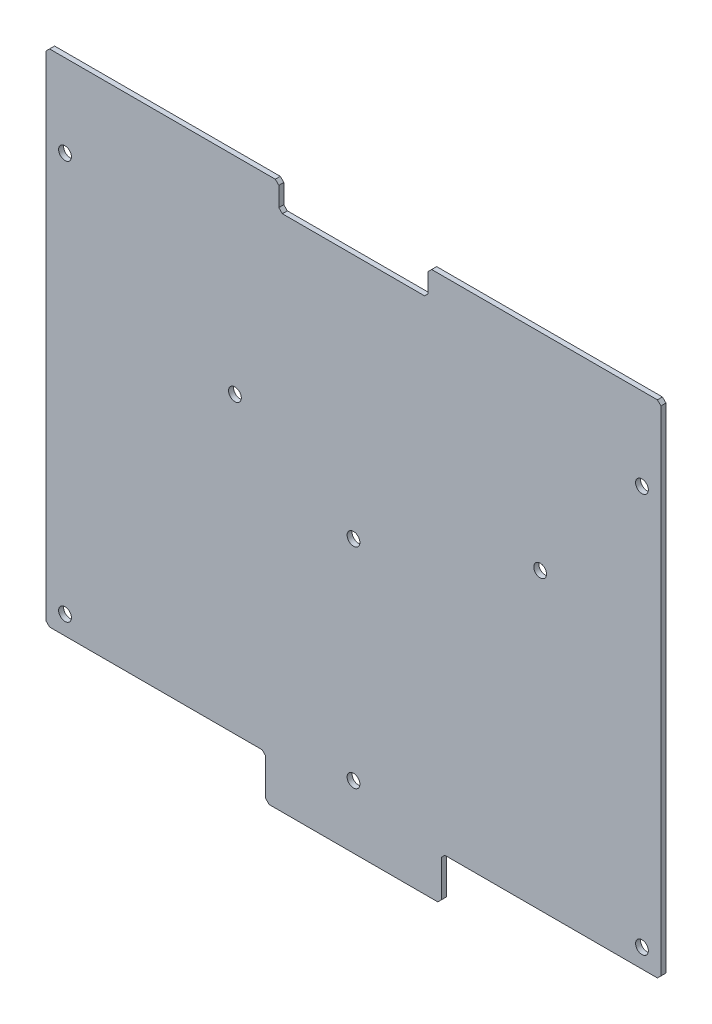
ISO-10303-21;
HEADER;
FILE_DESCRIPTION(('STEP AP214'),'2;1');
FILE_NAME('part.step','',(''),(''),'','','');
FILE_SCHEMA(('AUTOMOTIVE_DESIGN { 1 0 10303 214 1 1 1 1 }'));
ENDSEC;
DATA;
#1=APPLICATION_CONTEXT('core data for automotive mechanical design processes');
#2=APPLICATION_PROTOCOL_DEFINITION('international standard','automotive_design',2000,#1);
#3=PRODUCT_CONTEXT('',#1,'mechanical');
#4=PRODUCT('Part','Part','',(#3));
#5=PRODUCT_RELATED_PRODUCT_CATEGORY('part','',(#4));
#6=PRODUCT_DEFINITION_FORMATION('','',#4);
#7=PRODUCT_DEFINITION_CONTEXT('part definition',#1,'design');
#8=PRODUCT_DEFINITION('design','',#6,#7);
#9=PRODUCT_DEFINITION_SHAPE('','',#8);
#10=(LENGTH_UNIT() NAMED_UNIT(*) SI_UNIT(.MILLI.,.METRE.));
#11=(NAMED_UNIT(*) PLANE_ANGLE_UNIT() SI_UNIT($,.RADIAN.));
#12=(NAMED_UNIT(*) SI_UNIT($,.STERADIAN.) SOLID_ANGLE_UNIT());
#13=UNCERTAINTY_MEASURE_WITH_UNIT(LENGTH_MEASURE(1.E-05),#10,'distance_accuracy_value','');
#14=(GEOMETRIC_REPRESENTATION_CONTEXT(3) GLOBAL_UNCERTAINTY_ASSIGNED_CONTEXT((#13)) GLOBAL_UNIT_ASSIGNED_CONTEXT((#10,
#11,#12)) REPRESENTATION_CONTEXT('',''));
#15=CARTESIAN_POINT('',(0.,0.,0.));
#16=DIRECTION('',(0.,0.,1.));
#17=DIRECTION('',(1.,0.,0.));
#18=AXIS2_PLACEMENT_3D('',#15,#16,#17);
#19=CARTESIAN_POINT('',(0.,0.,1.4478));
#20=DIRECTION('',(0.,0.,1.));
#21=DIRECTION('',(1.,0.,0.));
#22=AXIS2_PLACEMENT_3D('',#19,#20,#21);
#23=PLANE('',#22);
#24=CARTESIAN_POINT('',(5.4864,120.904,1.4478));
#25=DIRECTION('',(0.,0.,1.));
#26=DIRECTION('',(1.,0.,0.));
#27=AXIS2_PLACEMENT_3D('',#24,#25,#26);
#28=CIRCLE('',#27,1.84912);
#29=CARTESIAN_POINT('',(7.33552,120.904,1.4478));
#30=VERTEX_POINT('',#29);
#31=EDGE_CURVE('E226',#30,#30,#28,.F.);
#32=ORIENTED_EDGE('',*,*,#31,.T.);
#33=EDGE_LOOP('',(#32));
#34=FACE_BOUND('',#33,.T.);
#35=CARTESIAN_POINT('',(142.875,85.09,1.4478));
#36=DIRECTION('',(0.,0.,1.));
#37=DIRECTION('',(1.,0.,0.));
#38=AXIS2_PLACEMENT_3D('',#35,#36,#37);
#39=CIRCLE('',#38,1.84912);
#40=CARTESIAN_POINT('',(144.72412,85.09,1.4478));
#41=VERTEX_POINT('',#40);
#42=EDGE_CURVE('E229',#41,#41,#39,.F.);
#43=ORIENTED_EDGE('',*,*,#42,.T.);
#44=EDGE_LOOP('',(#43));
#45=FACE_BOUND('',#44,.T.);
#46=CARTESIAN_POINT('',(54.61,85.09,1.4478));
#47=DIRECTION('',(0.,0.,1.));
#48=DIRECTION('',(1.,0.,0.));
#49=AXIS2_PLACEMENT_3D('',#46,#47,#48);
#50=CIRCLE('',#49,1.84912);
#51=CARTESIAN_POINT('',(56.45912,85.09,1.4478));
#52=VERTEX_POINT('',#51);
#53=EDGE_CURVE('E232',#52,#52,#50,.F.);
#54=ORIENTED_EDGE('',*,*,#53,.T.);
#55=EDGE_LOOP('',(#54));
#56=FACE_BOUND('',#55,.T.);
#57=CARTESIAN_POINT('',(88.9,66.04,1.4478));
#58=DIRECTION('',(0.,0.,1.));
#59=DIRECTION('',(1.,0.,0.));
#60=AXIS2_PLACEMENT_3D('',#57,#58,#59);
#61=CIRCLE('',#60,1.84912);
#62=CARTESIAN_POINT('',(90.74912,66.04,1.4478));
#63=VERTEX_POINT('',#62);
#64=EDGE_CURVE('E235',#63,#63,#61,.F.);
#65=ORIENTED_EDGE('',*,*,#64,.T.);
#66=EDGE_LOOP('',(#65));
#67=FACE_BOUND('',#66,.T.);
#68=CARTESIAN_POINT('',(88.9,5.4864,1.4478));
#69=DIRECTION('',(0.,0.,1.));
#70=DIRECTION('',(1.,0.,0.));
#71=AXIS2_PLACEMENT_3D('',#68,#69,#70);
#72=CIRCLE('',#71,1.84912);
#73=CARTESIAN_POINT('',(90.74912,5.4864,1.4478));
#74=VERTEX_POINT('',#73);
#75=EDGE_CURVE('E238',#74,#74,#72,.F.);
#76=ORIENTED_EDGE('',*,*,#75,.T.);
#77=EDGE_LOOP('',(#76));
#78=FACE_BOUND('',#77,.T.);
#79=CARTESIAN_POINT('',(172.3136,5.4864,1.4478));
#80=DIRECTION('',(0.,0.,1.));
#81=DIRECTION('',(1.,0.,0.));
#82=AXIS2_PLACEMENT_3D('',#79,#80,#81);
#83=CIRCLE('',#82,1.84912);
#84=CARTESIAN_POINT('',(174.16272,5.4864,1.4478));
#85=VERTEX_POINT('',#84);
#86=EDGE_CURVE('E241',#85,#85,#83,.F.);
#87=ORIENTED_EDGE('',*,*,#86,.T.);
#88=EDGE_LOOP('',(#87));
#89=FACE_BOUND('',#88,.T.);
#90=CARTESIAN_POINT('',(5.4864,5.4864,1.4478));
#91=DIRECTION('',(0.,0.,1.));
#92=DIRECTION('',(1.,0.,0.));
#93=AXIS2_PLACEMENT_3D('',#90,#91,#92);
#94=CIRCLE('',#93,1.84912);
#95=CARTESIAN_POINT('',(7.33552,5.4864,1.4478));
#96=VERTEX_POINT('',#95);
#97=EDGE_CURVE('E243',#96,#96,#94,.F.);
#98=ORIENTED_EDGE('',*,*,#97,.T.);
#99=EDGE_LOOP('',(#98));
#100=FACE_BOUND('',#99,.T.);
#101=CARTESIAN_POINT('',(172.3136,120.904,1.4478));
#102=DIRECTION('',(0.,0.,1.));
#103=DIRECTION('',(1.,0.,0.));
#104=AXIS2_PLACEMENT_3D('',#101,#102,#103);
#105=CIRCLE('',#104,1.84912);
#106=CARTESIAN_POINT('',(174.16272,120.904,1.4478));
#107=VERTEX_POINT('',#106);
#108=EDGE_CURVE('E20',#107,#107,#105,.F.);
#109=ORIENTED_EDGE('',*,*,#108,.T.);
#110=EDGE_LOOP('',(#109));
#111=FACE_BOUND('',#110,.T.);
#112=DIRECTION('',(1.,0.,0.));
#113=VECTOR('',#112,1.);
#114=CARTESIAN_POINT('',(63.5,-12.7,1.4478));
#115=LINE('',#114,#113);
#116=CARTESIAN_POINT('',(113.284,-12.7,1.4478));
#117=VERTEX_POINT('',#116);
#118=CARTESIAN_POINT('',(64.516,-12.7,1.4478));
#119=VERTEX_POINT('',#118);
#120=EDGE_CURVE('E193',#117,#119,#115,.F.);
#121=ORIENTED_EDGE('',*,*,#120,.F.);
#122=DIRECTION('',(0.707106781186498,0.707106781186598,0.));
#123=VECTOR('',#122,1.);
#124=CARTESIAN_POINT('',(113.792,-12.192,1.4478));
#125=LINE('',#124,#123);
#126=CARTESIAN_POINT('',(114.3,-11.684,1.4478));
#127=VERTEX_POINT('',#126);
#128=EDGE_CURVE('E189',#127,#117,#125,.F.);
#129=ORIENTED_EDGE('',*,*,#128,.F.);
#130=DIRECTION('',(0.,1.,0.));
#131=VECTOR('',#130,1.);
#132=CARTESIAN_POINT('',(114.3,-12.7,1.4478));
#133=LINE('',#132,#131);
#134=CARTESIAN_POINT('',(114.3,-1.01599999999999,1.4478));
#135=VERTEX_POINT('',#134);
#136=EDGE_CURVE('E180',#135,#127,#133,.F.);
#137=ORIENTED_EDGE('',*,*,#136,.F.);
#138=DIRECTION('',(0.707106781186598,0.707106781186498,0.));
#139=VECTOR('',#138,1.);
#140=CARTESIAN_POINT('',(114.808,-0.508,1.4478));
#141=LINE('',#140,#139);
#142=CARTESIAN_POINT('',(115.316,0.,1.4478));
#143=VERTEX_POINT('',#142);
#144=EDGE_CURVE('E175',#143,#135,#141,.F.);
#145=ORIENTED_EDGE('',*,*,#144,.F.);
#146=DIRECTION('',(1.,0.,0.));
#147=VECTOR('',#146,1.);
#148=CARTESIAN_POINT('',(0.,0.,1.4478));
#149=LINE('',#148,#147);
#150=CARTESIAN_POINT('',(176.784,0.,1.4478));
#151=VERTEX_POINT('',#150);
#152=EDGE_CURVE('E342',#151,#143,#149,.F.);
#153=ORIENTED_EDGE('',*,*,#152,.F.);
#154=DIRECTION('',(0.707106781186548,0.707106781186548,0.));
#155=VECTOR('',#154,1.);
#156=CARTESIAN_POINT('',(177.292,0.508,1.4478));
#157=LINE('',#156,#155);
#158=CARTESIAN_POINT('',(177.8,1.016,1.4478));
#159=VERTEX_POINT('',#158);
#160=EDGE_CURVE('E338',#159,#151,#157,.F.);
#161=ORIENTED_EDGE('',*,*,#160,.F.);
#162=DIRECTION('',(0.,1.,0.));
#163=VECTOR('',#162,1.);
#164=CARTESIAN_POINT('',(177.8,0.,1.4478));
#165=LINE('',#164,#163);
#166=CARTESIAN_POINT('',(177.8,143.764,1.4478));
#167=VERTEX_POINT('',#166);
#168=EDGE_CURVE('E334',#167,#159,#165,.F.);
#169=ORIENTED_EDGE('',*,*,#168,.F.);
#170=DIRECTION('',(-0.707106781186548,0.707106781186548,0.));
#171=VECTOR('',#170,1.);
#172=CARTESIAN_POINT('',(177.292,144.272,1.4478));
#173=LINE('',#172,#171);
#174=CARTESIAN_POINT('',(176.784,144.78,1.4478));
#175=VERTEX_POINT('',#174);
#176=EDGE_CURVE('E330',#175,#167,#173,.F.);
#177=ORIENTED_EDGE('',*,*,#176,.F.);
#178=DIRECTION('',(1.,0.,0.));
#179=VECTOR('',#178,1.);
#180=CARTESIAN_POINT('',(177.8,144.78,1.4478));
#181=LINE('',#180,#179);
#182=CARTESIAN_POINT('',(111.506,144.78,1.4478));
#183=VERTEX_POINT('',#182);
#184=EDGE_CURVE('E326',#183,#175,#181,.T.);
#185=ORIENTED_EDGE('',*,*,#184,.F.);
#186=DIRECTION('',(-0.707106781186548,-0.707106781186548,0.));
#187=VECTOR('',#186,1.);
#188=CARTESIAN_POINT('',(110.998,144.272,1.4478));
#189=LINE('',#188,#187);
#190=CARTESIAN_POINT('',(110.49,143.764,1.4478));
#191=VERTEX_POINT('',#190);
#192=EDGE_CURVE('E319',#191,#183,#189,.F.);
#193=ORIENTED_EDGE('',*,*,#192,.F.);
#194=DIRECTION('',(0.,1.,0.));
#195=VECTOR('',#194,1.);
#196=CARTESIAN_POINT('',(110.49,144.78,1.4478));
#197=LINE('',#196,#195);
#198=CARTESIAN_POINT('',(110.49,138.176,1.4478));
#199=VERTEX_POINT('',#198);
#200=EDGE_CURVE('E313',#191,#199,#197,.F.);
#201=ORIENTED_EDGE('',*,*,#200,.T.);
#202=DIRECTION('',(-0.707106781186548,-0.707106781186548,0.));
#203=VECTOR('',#202,1.);
#204=CARTESIAN_POINT('',(109.982,137.668,1.4478));
#205=LINE('',#204,#203);
#206=CARTESIAN_POINT('',(109.474,137.16,1.4478));
#207=VERTEX_POINT('',#206);
#208=EDGE_CURVE('E311',#207,#199,#205,.F.);
#209=ORIENTED_EDGE('',*,*,#208,.F.);
#210=DIRECTION('',(1.,0.,0.));
#211=VECTOR('',#210,1.);
#212=CARTESIAN_POINT('',(110.49,137.16,1.4478));
#213=LINE('',#212,#211);
#214=CARTESIAN_POINT('',(68.326,137.16,1.4478));
#215=VERTEX_POINT('',#214);
#216=EDGE_CURVE('E303',#207,#215,#213,.F.);
#217=ORIENTED_EDGE('',*,*,#216,.T.);
#218=DIRECTION('',(-0.707106781186498,0.707106781186598,0.));
#219=VECTOR('',#218,1.);
#220=CARTESIAN_POINT('',(67.818,137.668,1.4478));
#221=LINE('',#220,#219);
#222=CARTESIAN_POINT('',(67.31,138.176,1.4478));
#223=VERTEX_POINT('',#222);
#224=EDGE_CURVE('E301',#223,#215,#221,.F.);
#225=ORIENTED_EDGE('',*,*,#224,.F.);
#226=DIRECTION('',(0.,1.,0.));
#227=VECTOR('',#226,1.);
#228=CARTESIAN_POINT('',(67.31,137.16,1.4478));
#229=LINE('',#228,#227);
#230=CARTESIAN_POINT('',(67.31,143.764,1.4478));
#231=VERTEX_POINT('',#230);
#232=EDGE_CURVE('E293',#223,#231,#229,.T.);
#233=ORIENTED_EDGE('',*,*,#232,.T.);
#234=DIRECTION('',(-0.707106781186498,0.707106781186598,0.));
#235=VECTOR('',#234,1.);
#236=CARTESIAN_POINT('',(66.802,144.272,1.4478));
#237=LINE('',#236,#235);
#238=CARTESIAN_POINT('',(66.294,144.78,1.4478));
#239=VERTEX_POINT('',#238);
#240=EDGE_CURVE('E291',#239,#231,#237,.F.);
#241=ORIENTED_EDGE('',*,*,#240,.F.);
#242=DIRECTION('',(1.,0.,0.));
#243=VECTOR('',#242,1.);
#244=CARTESIAN_POINT('',(177.8,144.78,1.4478));
#245=LINE('',#244,#243);
#246=CARTESIAN_POINT('',(1.016,144.78,1.4478));
#247=VERTEX_POINT('',#246);
#248=EDGE_CURVE('E287',#247,#239,#245,.T.);
#249=ORIENTED_EDGE('',*,*,#248,.F.);
#250=DIRECTION('',(-0.707106781186548,-0.707106781186548,0.));
#251=VECTOR('',#250,1.);
#252=CARTESIAN_POINT('',(0.508,144.272,1.4478));
#253=LINE('',#252,#251);
#254=CARTESIAN_POINT('',(0.,143.764,1.4478));
#255=VERTEX_POINT('',#254);
#256=EDGE_CURVE('E283',#255,#247,#253,.F.);
#257=ORIENTED_EDGE('',*,*,#256,.F.);
#258=DIRECTION('',(0.,1.,0.));
#259=VECTOR('',#258,1.);
#260=CARTESIAN_POINT('',(0.,144.78,1.4478));
#261=LINE('',#260,#259);
#262=CARTESIAN_POINT('',(0.,1.016,1.4478));
#263=VERTEX_POINT('',#262);
#264=EDGE_CURVE('E279',#263,#255,#261,.T.);
#265=ORIENTED_EDGE('',*,*,#264,.F.);
#266=DIRECTION('',(0.707106781186548,-0.707106781186548,0.));
#267=VECTOR('',#266,1.);
#268=CARTESIAN_POINT('',(0.508,0.508,1.4478));
#269=LINE('',#268,#267);
#270=CARTESIAN_POINT('',(1.016,0.,1.4478));
#271=VERTEX_POINT('',#270);
#272=EDGE_CURVE('E275',#271,#263,#269,.F.);
#273=ORIENTED_EDGE('',*,*,#272,.F.);
#274=DIRECTION('',(1.,0.,0.));
#275=VECTOR('',#274,1.);
#276=CARTESIAN_POINT('',(0.,0.,1.4478));
#277=LINE('',#276,#275);
#278=CARTESIAN_POINT('',(62.484,0.,1.4478));
#279=VERTEX_POINT('',#278);
#280=EDGE_CURVE('E271',#279,#271,#277,.F.);
#281=ORIENTED_EDGE('',*,*,#280,.F.);
#282=DIRECTION('',(0.707106781186548,-0.707106781186548,0.));
#283=VECTOR('',#282,1.);
#284=CARTESIAN_POINT('',(62.992,-0.508,1.4478));
#285=LINE('',#284,#283);
#286=CARTESIAN_POINT('',(63.5,-1.016,1.4478));
#287=VERTEX_POINT('',#286);
#288=EDGE_CURVE('E267',#287,#279,#285,.F.);
#289=ORIENTED_EDGE('',*,*,#288,.F.);
#290=DIRECTION('',(0.,1.,0.));
#291=VECTOR('',#290,1.);
#292=CARTESIAN_POINT('',(63.5,0.,1.4478));
#293=LINE('',#292,#291);
#294=CARTESIAN_POINT('',(63.5,-11.684,1.4478));
#295=VERTEX_POINT('',#294);
#296=EDGE_CURVE('E263',#295,#287,#293,.T.);
#297=ORIENTED_EDGE('',*,*,#296,.F.);
#298=DIRECTION('',(0.707106781186548,-0.707106781186548,0.));
#299=VECTOR('',#298,1.);
#300=CARTESIAN_POINT('',(64.008,-12.192,1.4478));
#301=LINE('',#300,#299);
#302=EDGE_CURVE('E259',#119,#295,#301,.F.);
#303=ORIENTED_EDGE('',*,*,#302,.F.);
#304=EDGE_LOOP('',(#121,#129,#137,#145,#153,#161,#169,#177,#185,#193,#201,#209,#217,#225,#233,
#241,#249,#257,#265,#273,#281,#289,#297,#303));
#305=FACE_BOUND('',#304,.T.);
#306=ADVANCED_FACE('F17',(#34,#45,#56,#67,#78,#89,#100,#111,#305),#23,.T.);
#307=CARTESIAN_POINT('',(113.792,-12.192,0.7239));
#308=DIRECTION('',(0.707106781186598,-0.707106781186498,0.));
#309=DIRECTION('',(0.707106781186498,0.707106781186598,0.));
#310=AXIS2_PLACEMENT_3D('',#307,#308,#309);
#311=PLANE('',#310);
#312=DIRECTION('',(0.,0.,-1.));
#313=VECTOR('',#312,1.);
#314=CARTESIAN_POINT('',(113.284,-12.7,1.4478));
#315=LINE('',#314,#313);
#316=CARTESIAN_POINT('',(113.284,-12.7,0.));
#317=VERTEX_POINT('',#316);
#318=EDGE_CURVE('E248',#317,#117,#315,.F.);
#319=ORIENTED_EDGE('',*,*,#318,.F.);
#320=DIRECTION('',(0.707106781186549,0.707106781186546,0.));
#321=VECTOR('',#320,1.);
#322=CARTESIAN_POINT('',(113.284,-12.7,0.));
#323=LINE('',#322,#321);
#324=CARTESIAN_POINT('',(114.3,-11.684,0.));
#325=VERTEX_POINT('',#324);
#326=EDGE_CURVE('E200',#317,#325,#323,.T.);
#327=ORIENTED_EDGE('',*,*,#326,.T.);
#328=DIRECTION('',(0.,0.,-1.));
#329=VECTOR('',#328,1.);
#330=CARTESIAN_POINT('',(114.3,-11.684,1.4478));
#331=LINE('',#330,#329);
#332=EDGE_CURVE('E185',#127,#325,#331,.T.);
#333=ORIENTED_EDGE('',*,*,#332,.F.);
#334=ORIENTED_EDGE('',*,*,#128,.T.);
#335=EDGE_LOOP('',(#319,#327,#333,#334));
#336=FACE_BOUND('',#335,.T.);
#337=ADVANCED_FACE('F199',(#336),#311,.T.);
#338=CARTESIAN_POINT('',(114.3,-12.7,1.4478));
#339=DIRECTION('',(1.,0.,0.));
#340=DIRECTION('',(0.,0.,-1.));
#341=AXIS2_PLACEMENT_3D('',#338,#339,#340);
#342=PLANE('',#341);
#343=ORIENTED_EDGE('',*,*,#136,.T.);
#344=ORIENTED_EDGE('',*,*,#332,.T.);
#345=DIRECTION('',(0.,1.,0.));
#346=VECTOR('',#345,1.);
#347=CARTESIAN_POINT('',(114.3,0.,0.));
#348=LINE('',#347,#346);
#349=CARTESIAN_POINT('',(114.3,-1.01599999999999,0.));
#350=VERTEX_POINT('',#349);
#351=EDGE_CURVE('E351',#325,#350,#348,.T.);
#352=ORIENTED_EDGE('',*,*,#351,.T.);
#353=DIRECTION('',(0.,0.,1.));
#354=VECTOR('',#353,1.);
#355=CARTESIAN_POINT('',(114.3,-1.01599999999995,0.7239));
#356=LINE('',#355,#354);
#357=EDGE_CURVE('E187',#135,#350,#356,.F.);
#358=ORIENTED_EDGE('',*,*,#357,.F.);
#359=EDGE_LOOP('',(#343,#344,#352,#358));
#360=FACE_BOUND('',#359,.T.);
#361=ADVANCED_FACE('F182',(#360),#342,.T.);
#362=CARTESIAN_POINT('',(114.808,-0.508,0.7239));
#363=DIRECTION('',(0.707106781186498,-0.707106781186598,0.));
#364=DIRECTION('',(0.707106781186598,0.707106781186498,0.));
#365=AXIS2_PLACEMENT_3D('',#362,#363,#364);
#366=PLANE('',#365);
#367=DIRECTION('',(0.707106781186549,0.707106781186546,0.));
#368=VECTOR('',#367,1.);
#369=CARTESIAN_POINT('',(114.3,-1.016,0.));
#370=LINE('',#369,#368);
#371=CARTESIAN_POINT('',(115.316,0.,0.));
#372=VERTEX_POINT('',#371);
#373=EDGE_CURVE('E346',#350,#372,#370,.T.);
#374=ORIENTED_EDGE('',*,*,#373,.T.);
#375=DIRECTION('',(0.,0.,-1.));
#376=VECTOR('',#375,1.);
#377=CARTESIAN_POINT('',(115.316,0.,0.));
#378=LINE('',#377,#376);
#379=EDGE_CURVE('E340',#143,#372,#378,.T.);
#380=ORIENTED_EDGE('',*,*,#379,.F.);
#381=ORIENTED_EDGE('',*,*,#144,.T.);
#382=ORIENTED_EDGE('',*,*,#357,.T.);
#383=EDGE_LOOP('',(#374,#380,#381,#382));
#384=FACE_BOUND('',#383,.T.);
#385=ADVANCED_FACE('F345',(#384),#366,.T.);
#386=CARTESIAN_POINT('',(0.,0.,0.));
#387=DIRECTION('',(0.,-1.,0.));
#388=DIRECTION('',(0.,0.,-1.));
#389=AXIS2_PLACEMENT_3D('',#386,#387,#388);
#390=PLANE('',#389);
#391=ORIENTED_EDGE('',*,*,#152,.T.);
#392=ORIENTED_EDGE('',*,*,#379,.T.);
#393=DIRECTION('',(1.,0.,0.));
#394=VECTOR('',#393,1.);
#395=CARTESIAN_POINT('',(0.,0.,0.));
#396=LINE('',#395,#394);
#397=CARTESIAN_POINT('',(176.784,0.,0.));
#398=VERTEX_POINT('',#397);
#399=EDGE_CURVE('E354',#372,#398,#396,.T.);
#400=ORIENTED_EDGE('',*,*,#399,.T.);
#401=DIRECTION('',(0.,0.,1.));
#402=VECTOR('',#401,1.);
#403=CARTESIAN_POINT('',(176.784,0.,0.7239));
#404=LINE('',#403,#402);
#405=EDGE_CURVE('E336',#151,#398,#404,.F.);
#406=ORIENTED_EDGE('',*,*,#405,.F.);
#407=EDGE_LOOP('',(#391,#392,#400,#406));
#408=FACE_BOUND('',#407,.T.);
#409=ADVANCED_FACE('F503',(#408),#390,.T.);
#410=CARTESIAN_POINT('',(177.292,0.508,0.7239));
#411=DIRECTION('',(0.707106781186548,-0.707106781186548,0.));
#412=DIRECTION('',(0.707106781186548,0.707106781186548,0.));
#413=AXIS2_PLACEMENT_3D('',#410,#411,#412);
#414=PLANE('',#413);
#415=ORIENTED_EDGE('',*,*,#405,.T.);
#416=DIRECTION('',(0.707106781186544,0.707106781186551,0.));
#417=VECTOR('',#416,1.);
#418=CARTESIAN_POINT('',(176.784,0.,0.));
#419=LINE('',#418,#417);
#420=CARTESIAN_POINT('',(177.8,1.01599999999999,0.));
#421=VERTEX_POINT('',#420);
#422=EDGE_CURVE('E358',#398,#421,#419,.T.);
#423=ORIENTED_EDGE('',*,*,#422,.T.);
#424=DIRECTION('',(0.,0.,-1.));
#425=VECTOR('',#424,1.);
#426=CARTESIAN_POINT('',(177.8,1.016,0.));
#427=LINE('',#426,#425);
#428=EDGE_CURVE('E332',#159,#421,#427,.T.);
#429=ORIENTED_EDGE('',*,*,#428,.F.);
#430=ORIENTED_EDGE('',*,*,#160,.T.);
#431=EDGE_LOOP('',(#415,#423,#429,#430));
#432=FACE_BOUND('',#431,.T.);
#433=ADVANCED_FACE('F499',(#432),#414,.T.);
#434=CARTESIAN_POINT('',(177.8,0.,0.));
#435=DIRECTION('',(1.,0.,0.));
#436=DIRECTION('',(0.,0.,-1.));
#437=AXIS2_PLACEMENT_3D('',#434,#435,#436);
#438=PLANE('',#437);
#439=DIRECTION('',(0.,1.,0.));
#440=VECTOR('',#439,1.);
#441=CARTESIAN_POINT('',(177.8,0.,0.));
#442=LINE('',#441,#440);
#443=CARTESIAN_POINT('',(177.8,143.764,0.));
#444=VERTEX_POINT('',#443);
#445=EDGE_CURVE('E361',#421,#444,#442,.T.);
#446=ORIENTED_EDGE('',*,*,#445,.T.);
#447=DIRECTION('',(0.,0.,1.));
#448=VECTOR('',#447,1.);
#449=CARTESIAN_POINT('',(177.8,143.764,0.7239));
#450=LINE('',#449,#448);
#451=EDGE_CURVE('E328',#167,#444,#450,.F.);
#452=ORIENTED_EDGE('',*,*,#451,.F.);
#453=ORIENTED_EDGE('',*,*,#168,.T.);
#454=ORIENTED_EDGE('',*,*,#428,.T.);
#455=EDGE_LOOP('',(#446,#452,#453,#454));
#456=FACE_BOUND('',#455,.T.);
#457=ADVANCED_FACE('F495',(#456),#438,.T.);
#458=CARTESIAN_POINT('',(177.292,144.272,0.7239));
#459=DIRECTION('',(0.707106781186548,0.707106781186548,0.));
#460=DIRECTION('',(-0.707106781186548,0.707106781186548,0.));
#461=AXIS2_PLACEMENT_3D('',#458,#459,#460);
#462=PLANE('',#461);
#463=ORIENTED_EDGE('',*,*,#451,.T.);
#464=DIRECTION('',(-0.707106781186548,0.707106781186548,0.));
#465=VECTOR('',#464,1.);
#466=CARTESIAN_POINT('',(177.8,143.764,0.));
#467=LINE('',#466,#465);
#468=CARTESIAN_POINT('',(176.784,144.78,0.));
#469=VERTEX_POINT('',#468);
#470=EDGE_CURVE('E364',#444,#469,#467,.T.);
#471=ORIENTED_EDGE('',*,*,#470,.T.);
#472=DIRECTION('',(0.,0.,1.));
#473=VECTOR('',#472,1.);
#474=CARTESIAN_POINT('',(176.784,144.78,0.));
#475=LINE('',#474,#473);
#476=EDGE_CURVE('E324',#175,#469,#475,.F.);
#477=ORIENTED_EDGE('',*,*,#476,.F.);
#478=ORIENTED_EDGE('',*,*,#176,.T.);
#479=EDGE_LOOP('',(#463,#471,#477,#478));
#480=FACE_BOUND('',#479,.T.);
#481=ADVANCED_FACE('F491',(#480),#462,.T.);
#482=CARTESIAN_POINT('',(177.8,144.78,0.));
#483=DIRECTION('',(0.,1.,0.));
#484=DIRECTION('',(0.,0.,1.));
#485=AXIS2_PLACEMENT_3D('',#482,#483,#484);
#486=PLANE('',#485);
#487=ORIENTED_EDGE('',*,*,#184,.T.);
#488=ORIENTED_EDGE('',*,*,#476,.T.);
#489=DIRECTION('',(1.,0.,0.));
#490=VECTOR('',#489,1.);
#491=CARTESIAN_POINT('',(0.,144.78,0.));
#492=LINE('',#491,#490);
#493=CARTESIAN_POINT('',(111.506,144.78,0.));
#494=VERTEX_POINT('',#493);
#495=EDGE_CURVE('E367',#469,#494,#492,.F.);
#496=ORIENTED_EDGE('',*,*,#495,.T.);
#497=DIRECTION('',(0.,0.,1.));
#498=VECTOR('',#497,1.);
#499=CARTESIAN_POINT('',(111.506,144.78,0.7239));
#500=LINE('',#499,#498);
#501=EDGE_CURVE('E322',#183,#494,#500,.F.);
#502=ORIENTED_EDGE('',*,*,#501,.F.);
#503=EDGE_LOOP('',(#487,#488,#496,#502));
#504=FACE_BOUND('',#503,.T.);
#505=ADVANCED_FACE('F485',(#504),#486,.T.);
#506=CARTESIAN_POINT('',(110.998,144.272,0.7239));
#507=DIRECTION('',(-0.707106781186548,0.707106781186548,0.));
#508=DIRECTION('',(-0.707106781186548,-0.707106781186548,0.));
#509=AXIS2_PLACEMENT_3D('',#506,#507,#508);
#510=PLANE('',#509);
#511=DIRECTION('',(0.,0.,-1.));
#512=VECTOR('',#511,1.);
#513=CARTESIAN_POINT('',(110.49,143.764,0.));
#514=LINE('',#513,#512);
#515=CARTESIAN_POINT('',(110.49,143.764,0.));
#516=VERTEX_POINT('',#515);
#517=EDGE_CURVE('E316',#516,#191,#514,.F.);
#518=ORIENTED_EDGE('',*,*,#517,.T.);
#519=ORIENTED_EDGE('',*,*,#192,.T.);
#520=ORIENTED_EDGE('',*,*,#501,.T.);
#521=DIRECTION('',(-0.707106781186552,-0.707106781186543,0.));
#522=VECTOR('',#521,1.);
#523=CARTESIAN_POINT('',(111.506,144.78,0.));
#524=LINE('',#523,#522);
#525=EDGE_CURVE('E370',#494,#516,#524,.T.);
#526=ORIENTED_EDGE('',*,*,#525,.T.);
#527=EDGE_LOOP('',(#518,#519,#520,#526));
#528=FACE_BOUND('',#527,.T.);
#529=ADVANCED_FACE('F482',(#528),#510,.T.);
#530=CARTESIAN_POINT('',(110.49,144.78,0.));
#531=DIRECTION('',(1.,0.,0.));
#532=DIRECTION('',(0.,0.,-1.));
#533=AXIS2_PLACEMENT_3D('',#530,#531,#532);
#534=PLANE('',#533);
#535=DIRECTION('',(0.,0.,1.));
#536=VECTOR('',#535,1.);
#537=CARTESIAN_POINT('',(110.49,138.176,0.7239));
#538=LINE('',#537,#536);
#539=CARTESIAN_POINT('',(110.49,138.176,0.));
#540=VERTEX_POINT('',#539);
#541=EDGE_CURVE('E309',#199,#540,#538,.F.);
#542=ORIENTED_EDGE('',*,*,#541,.F.);
#543=ORIENTED_EDGE('',*,*,#200,.F.);
#544=ORIENTED_EDGE('',*,*,#517,.F.);
#545=DIRECTION('',(0.,1.,0.));
#546=VECTOR('',#545,1.);
#547=CARTESIAN_POINT('',(110.49,0.,0.));
#548=LINE('',#547,#546);
#549=EDGE_CURVE('E373',#516,#540,#548,.F.);
#550=ORIENTED_EDGE('',*,*,#549,.T.);
#551=EDGE_LOOP('',(#542,#543,#544,#550));
#552=FACE_BOUND('',#551,.T.);
#553=ADVANCED_FACE('F478',(#552),#534,.F.);
#554=CARTESIAN_POINT('',(109.982,137.668,0.7239));
#555=DIRECTION('',(-0.707106781186548,0.707106781186548,0.));
#556=DIRECTION('',(-0.707106781186548,-0.707106781186548,0.));
#557=AXIS2_PLACEMENT_3D('',#554,#555,#556);
#558=PLANE('',#557);
#559=DIRECTION('',(-0.707106781186552,-0.707106781186543,0.));
#560=VECTOR('',#559,1.);
#561=CARTESIAN_POINT('',(110.49,138.176,0.));
#562=LINE('',#561,#560);
#563=CARTESIAN_POINT('',(109.474,137.16,0.));
#564=VERTEX_POINT('',#563);
#565=EDGE_CURVE('E376',#540,#564,#562,.T.);
#566=ORIENTED_EDGE('',*,*,#565,.T.);
#567=DIRECTION('',(0.,0.,-1.));
#568=VECTOR('',#567,1.);
#569=CARTESIAN_POINT('',(109.474,137.16,0.));
#570=LINE('',#569,#568);
#571=EDGE_CURVE('E306',#564,#207,#570,.F.);
#572=ORIENTED_EDGE('',*,*,#571,.T.);
#573=ORIENTED_EDGE('',*,*,#208,.T.);
#574=ORIENTED_EDGE('',*,*,#541,.T.);
#575=EDGE_LOOP('',(#566,#572,#573,#574));
#576=FACE_BOUND('',#575,.T.);
#577=ADVANCED_FACE('F474',(#576),#558,.T.);
#578=CARTESIAN_POINT('',(110.49,137.16,0.));
#579=DIRECTION('',(0.,-1.,0.));
#580=DIRECTION('',(0.,0.,-1.));
#581=AXIS2_PLACEMENT_3D('',#578,#579,#580);
#582=PLANE('',#581);
#583=ORIENTED_EDGE('',*,*,#571,.F.);
#584=DIRECTION('',(1.,0.,0.));
#585=VECTOR('',#584,1.);
#586=CARTESIAN_POINT('',(0.,137.16,0.));
#587=LINE('',#586,#585);
#588=CARTESIAN_POINT('',(68.326,137.16,0.));
#589=VERTEX_POINT('',#588);
#590=EDGE_CURVE('E379',#564,#589,#587,.F.);
#591=ORIENTED_EDGE('',*,*,#590,.T.);
#592=DIRECTION('',(0.,0.,1.));
#593=VECTOR('',#592,1.);
#594=CARTESIAN_POINT('',(68.3259999999999,137.16,0.7239));
#595=LINE('',#594,#593);
#596=EDGE_CURVE('E299',#215,#589,#595,.F.);
#597=ORIENTED_EDGE('',*,*,#596,.F.);
#598=ORIENTED_EDGE('',*,*,#216,.F.);
#599=EDGE_LOOP('',(#583,#591,#597,#598));
#600=FACE_BOUND('',#599,.T.);
#601=ADVANCED_FACE('F470',(#600),#582,.F.);
#602=CARTESIAN_POINT('',(67.818,137.668,0.7239));
#603=DIRECTION('',(0.707106781186598,0.707106781186498,0.));
#604=DIRECTION('',(-0.707106781186498,0.707106781186598,0.));
#605=AXIS2_PLACEMENT_3D('',#602,#603,#604);
#606=PLANE('',#605);
#607=DIRECTION('',(-0.707106781186552,0.707106781186543,0.));
#608=VECTOR('',#607,1.);
#609=CARTESIAN_POINT('',(68.326,137.16,0.));
#610=LINE('',#609,#608);
#611=CARTESIAN_POINT('',(67.31,138.176,0.));
#612=VERTEX_POINT('',#611);
#613=EDGE_CURVE('E382',#589,#612,#610,.T.);
#614=ORIENTED_EDGE('',*,*,#613,.T.);
#615=DIRECTION('',(0.,0.,1.));
#616=VECTOR('',#615,1.);
#617=CARTESIAN_POINT('',(67.31,138.176,0.));
#618=LINE('',#617,#616);
#619=EDGE_CURVE('E296',#612,#223,#618,.T.);
#620=ORIENTED_EDGE('',*,*,#619,.T.);
#621=ORIENTED_EDGE('',*,*,#224,.T.);
#622=ORIENTED_EDGE('',*,*,#596,.T.);
#623=EDGE_LOOP('',(#614,#620,#621,#622));
#624=FACE_BOUND('',#623,.T.);
#625=ADVANCED_FACE('F466',(#624),#606,.T.);
#626=CARTESIAN_POINT('',(67.31,137.16,0.));
#627=DIRECTION('',(-1.,0.,0.));
#628=DIRECTION('',(0.,0.,1.));
#629=AXIS2_PLACEMENT_3D('',#626,#627,#628);
#630=PLANE('',#629);
#631=ORIENTED_EDGE('',*,*,#619,.F.);
#632=DIRECTION('',(0.,1.,0.));
#633=VECTOR('',#632,1.);
#634=CARTESIAN_POINT('',(67.31,0.,0.));
#635=LINE('',#634,#633);
#636=CARTESIAN_POINT('',(67.31,143.764,0.));
#637=VERTEX_POINT('',#636);
#638=EDGE_CURVE('E385',#612,#637,#635,.T.);
#639=ORIENTED_EDGE('',*,*,#638,.T.);
#640=DIRECTION('',(0.,0.,1.));
#641=VECTOR('',#640,1.);
#642=CARTESIAN_POINT('',(67.31,143.764,0.7239));
#643=LINE('',#642,#641);
#644=EDGE_CURVE('E289',#231,#637,#643,.F.);
#645=ORIENTED_EDGE('',*,*,#644,.F.);
#646=ORIENTED_EDGE('',*,*,#232,.F.);
#647=EDGE_LOOP('',(#631,#639,#645,#646));
#648=FACE_BOUND('',#647,.T.);
#649=ADVANCED_FACE('F462',(#648),#630,.F.);
#650=CARTESIAN_POINT('',(66.802,144.272,0.7239));
#651=DIRECTION('',(0.707106781186598,0.707106781186498,0.));
#652=DIRECTION('',(-0.707106781186498,0.707106781186598,0.));
#653=AXIS2_PLACEMENT_3D('',#650,#651,#652);
#654=PLANE('',#653);
#655=ORIENTED_EDGE('',*,*,#644,.T.);
#656=DIRECTION('',(-0.707106781186552,0.707106781186543,0.));
#657=VECTOR('',#656,1.);
#658=CARTESIAN_POINT('',(67.31,143.764,0.));
#659=LINE('',#658,#657);
#660=CARTESIAN_POINT('',(66.294,144.78,0.));
#661=VERTEX_POINT('',#660);
#662=EDGE_CURVE('E388',#637,#661,#659,.T.);
#663=ORIENTED_EDGE('',*,*,#662,.T.);
#664=DIRECTION('',(0.,0.,1.));
#665=VECTOR('',#664,1.);
#666=CARTESIAN_POINT('',(66.294,144.78,0.));
#667=LINE('',#666,#665);
#668=EDGE_CURVE('E285',#239,#661,#667,.F.);
#669=ORIENTED_EDGE('',*,*,#668,.F.);
#670=ORIENTED_EDGE('',*,*,#240,.T.);
#671=EDGE_LOOP('',(#655,#663,#669,#670));
#672=FACE_BOUND('',#671,.T.);
#673=ADVANCED_FACE('F458',(#672),#654,.T.);
#674=CARTESIAN_POINT('',(177.8,144.78,0.));
#675=DIRECTION('',(0.,1.,0.));
#676=DIRECTION('',(0.,0.,1.));
#677=AXIS2_PLACEMENT_3D('',#674,#675,#676);
#678=PLANE('',#677);
#679=DIRECTION('',(1.,0.,0.));
#680=VECTOR('',#679,1.);
#681=CARTESIAN_POINT('',(0.,144.78,0.));
#682=LINE('',#681,#680);
#683=CARTESIAN_POINT('',(1.016,144.78,0.));
#684=VERTEX_POINT('',#683);
#685=EDGE_CURVE('E391',#661,#684,#682,.F.);
#686=ORIENTED_EDGE('',*,*,#685,.T.);
#687=DIRECTION('',(0.,0.,1.));
#688=VECTOR('',#687,1.);
#689=CARTESIAN_POINT('',(1.01600000000001,144.78,0.7239));
#690=LINE('',#689,#688);
#691=EDGE_CURVE('E281',#247,#684,#690,.F.);
#692=ORIENTED_EDGE('',*,*,#691,.F.);
#693=ORIENTED_EDGE('',*,*,#248,.T.);
#694=ORIENTED_EDGE('',*,*,#668,.T.);
#695=EDGE_LOOP('',(#686,#692,#693,#694));
#696=FACE_BOUND('',#695,.T.);
#697=ADVANCED_FACE('F452',(#696),#678,.T.);
#698=CARTESIAN_POINT('',(0.508,144.272,0.7239));
#699=DIRECTION('',(-0.707106781186548,0.707106781186548,0.));
#700=DIRECTION('',(-0.707106781186548,-0.707106781186548,0.));
#701=AXIS2_PLACEMENT_3D('',#698,#699,#700);
#702=PLANE('',#701);
#703=ORIENTED_EDGE('',*,*,#691,.T.);
#704=DIRECTION('',(-0.707106781186551,-0.707106781186544,0.));
#705=VECTOR('',#704,1.);
#706=CARTESIAN_POINT('',(1.016,144.78,0.));
#707=LINE('',#706,#705);
#708=CARTESIAN_POINT('',(0.,143.764,0.));
#709=VERTEX_POINT('',#708);
#710=EDGE_CURVE('E394',#684,#709,#707,.T.);
#711=ORIENTED_EDGE('',*,*,#710,.T.);
#712=DIRECTION('',(0.,0.,1.));
#713=VECTOR('',#712,1.);
#714=CARTESIAN_POINT('',(0.,143.764,0.));
#715=LINE('',#714,#713);
#716=EDGE_CURVE('E277',#255,#709,#715,.F.);
#717=ORIENTED_EDGE('',*,*,#716,.F.);
#718=ORIENTED_EDGE('',*,*,#256,.T.);
#719=EDGE_LOOP('',(#703,#711,#717,#718));
#720=FACE_BOUND('',#719,.T.);
#721=ADVANCED_FACE('F448',(#720),#702,.T.);
#722=CARTESIAN_POINT('',(0.,144.78,0.));
#723=DIRECTION('',(-1.,0.,0.));
#724=DIRECTION('',(0.,0.,1.));
#725=AXIS2_PLACEMENT_3D('',#722,#723,#724);
#726=PLANE('',#725);
#727=ORIENTED_EDGE('',*,*,#264,.T.);
#728=ORIENTED_EDGE('',*,*,#716,.T.);
#729=DIRECTION('',(0.,1.,0.));
#730=VECTOR('',#729,1.);
#731=CARTESIAN_POINT('',(0.,0.,0.));
#732=LINE('',#731,#730);
#733=CARTESIAN_POINT('',(0.,1.01599999999999,0.));
#734=VERTEX_POINT('',#733);
#735=EDGE_CURVE('E397',#709,#734,#732,.F.);
#736=ORIENTED_EDGE('',*,*,#735,.T.);
#737=DIRECTION('',(0.,0.,1.));
#738=VECTOR('',#737,1.);
#739=CARTESIAN_POINT('',(0.,1.016,0.7239));
#740=LINE('',#739,#738);
#741=EDGE_CURVE('E273',#263,#734,#740,.F.);
#742=ORIENTED_EDGE('',*,*,#741,.F.);
#743=EDGE_LOOP('',(#727,#728,#736,#742));
#744=FACE_BOUND('',#743,.T.);
#745=ADVANCED_FACE('F442',(#744),#726,.T.);
#746=CARTESIAN_POINT('',(0.508,0.508,0.7239));
#747=DIRECTION('',(-0.707106781186548,-0.707106781186548,0.));
#748=DIRECTION('',(0.707106781186548,-0.707106781186548,0.));
#749=AXIS2_PLACEMENT_3D('',#746,#747,#748);
#750=PLANE('',#749);
#751=ORIENTED_EDGE('',*,*,#741,.T.);
#752=DIRECTION('',(0.707106781186548,-0.707106781186548,0.));
#753=VECTOR('',#752,1.);
#754=CARTESIAN_POINT('',(0.,1.016,0.));
#755=LINE('',#754,#753);
#756=CARTESIAN_POINT('',(1.016,0.,0.));
#757=VERTEX_POINT('',#756);
#758=EDGE_CURVE('E400',#734,#757,#755,.T.);
#759=ORIENTED_EDGE('',*,*,#758,.T.);
#760=DIRECTION('',(0.,0.,-1.));
#761=VECTOR('',#760,1.);
#762=CARTESIAN_POINT('',(1.016,0.,0.));
#763=LINE('',#762,#761);
#764=EDGE_CURVE('E269',#271,#757,#763,.T.);
#765=ORIENTED_EDGE('',*,*,#764,.F.);
#766=ORIENTED_EDGE('',*,*,#272,.T.);
#767=EDGE_LOOP('',(#751,#759,#765,#766));
#768=FACE_BOUND('',#767,.T.);
#769=ADVANCED_FACE('F438',(#768),#750,.T.);
#770=CARTESIAN_POINT('',(0.,0.,0.));
#771=DIRECTION('',(0.,-1.,0.));
#772=DIRECTION('',(0.,0.,-1.));
#773=AXIS2_PLACEMENT_3D('',#770,#771,#772);
#774=PLANE('',#773);
#775=ORIENTED_EDGE('',*,*,#764,.T.);
#776=DIRECTION('',(1.,0.,0.));
#777=VECTOR('',#776,1.);
#778=CARTESIAN_POINT('',(0.,0.,0.));
#779=LINE('',#778,#777);
#780=CARTESIAN_POINT('',(62.484,0.,0.));
#781=VERTEX_POINT('',#780);
#782=EDGE_CURVE('E403',#757,#781,#779,.T.);
#783=ORIENTED_EDGE('',*,*,#782,.T.);
#784=DIRECTION('',(0.,0.,1.));
#785=VECTOR('',#784,1.);
#786=CARTESIAN_POINT('',(62.484,0.,0.7239));
#787=LINE('',#786,#785);
#788=EDGE_CURVE('E265',#279,#781,#787,.F.);
#789=ORIENTED_EDGE('',*,*,#788,.F.);
#790=ORIENTED_EDGE('',*,*,#280,.T.);
#791=EDGE_LOOP('',(#775,#783,#789,#790));
#792=FACE_BOUND('',#791,.T.);
#793=ADVANCED_FACE('F432',(#792),#774,.T.);
#794=CARTESIAN_POINT('',(62.992,-0.508,0.7239));
#795=DIRECTION('',(-0.707106781186548,-0.707106781186548,0.));
#796=DIRECTION('',(0.707106781186548,-0.707106781186548,0.));
#797=AXIS2_PLACEMENT_3D('',#794,#795,#796);
#798=PLANE('',#797);
#799=ORIENTED_EDGE('',*,*,#288,.T.);
#800=ORIENTED_EDGE('',*,*,#788,.T.);
#801=DIRECTION('',(0.707106781186549,-0.707106781186546,0.));
#802=VECTOR('',#801,1.);
#803=CARTESIAN_POINT('',(62.484,0.,0.));
#804=LINE('',#803,#802);
#805=CARTESIAN_POINT('',(63.5,-1.016,0.));
#806=VERTEX_POINT('',#805);
#807=EDGE_CURVE('E406',#781,#806,#804,.T.);
#808=ORIENTED_EDGE('',*,*,#807,.T.);
#809=DIRECTION('',(0.,0.,1.));
#810=VECTOR('',#809,1.);
#811=CARTESIAN_POINT('',(63.5,-1.016,1.4478));
#812=LINE('',#811,#810);
#813=EDGE_CURVE('E261',#287,#806,#812,.F.);
#814=ORIENTED_EDGE('',*,*,#813,.F.);
#815=EDGE_LOOP('',(#799,#800,#808,#814));
#816=FACE_BOUND('',#815,.T.);
#817=ADVANCED_FACE('F428',(#816),#798,.T.);
#818=CARTESIAN_POINT('',(63.5,0.,1.4478));
#819=DIRECTION('',(-1.,0.,0.));
#820=DIRECTION('',(0.,0.,1.));
#821=AXIS2_PLACEMENT_3D('',#818,#819,#820);
#822=PLANE('',#821);
#823=DIRECTION('',(0.,1.,0.));
#824=VECTOR('',#823,1.);
#825=CARTESIAN_POINT('',(63.5,0.,0.));
#826=LINE('',#825,#824);
#827=CARTESIAN_POINT('',(63.5,-11.684,0.));
#828=VERTEX_POINT('',#827);
#829=EDGE_CURVE('E409',#806,#828,#826,.F.);
#830=ORIENTED_EDGE('',*,*,#829,.T.);
#831=DIRECTION('',(0.,0.,1.));
#832=VECTOR('',#831,1.);
#833=CARTESIAN_POINT('',(63.5,-11.684,0.7239));
#834=LINE('',#833,#832);
#835=EDGE_CURVE('E257',#295,#828,#834,.F.);
#836=ORIENTED_EDGE('',*,*,#835,.F.);
#837=ORIENTED_EDGE('',*,*,#296,.T.);
#838=ORIENTED_EDGE('',*,*,#813,.T.);
#839=EDGE_LOOP('',(#830,#836,#837,#838));
#840=FACE_BOUND('',#839,.T.);
#841=ADVANCED_FACE('F422',(#840),#822,.T.);
#842=CARTESIAN_POINT('',(64.008,-12.192,0.7239));
#843=DIRECTION('',(-0.707106781186548,-0.707106781186548,0.));
#844=DIRECTION('',(0.707106781186548,-0.707106781186548,0.));
#845=AXIS2_PLACEMENT_3D('',#842,#843,#844);
#846=PLANE('',#845);
#847=ORIENTED_EDGE('',*,*,#835,.T.);
#848=DIRECTION('',(0.707106781186549,-0.707106781186546,0.));
#849=VECTOR('',#848,1.);
#850=CARTESIAN_POINT('',(63.5,-11.684,0.));
#851=LINE('',#850,#849);
#852=CARTESIAN_POINT('',(64.516,-12.7,0.));
#853=VERTEX_POINT('',#852);
#854=EDGE_CURVE('E412',#828,#853,#851,.T.);
#855=ORIENTED_EDGE('',*,*,#854,.T.);
#856=DIRECTION('',(0.,0.,-1.));
#857=VECTOR('',#856,1.);
#858=CARTESIAN_POINT('',(64.516,-12.7,1.4478));
#859=LINE('',#858,#857);
#860=EDGE_CURVE('E35',#119,#853,#859,.T.);
#861=ORIENTED_EDGE('',*,*,#860,.F.);
#862=ORIENTED_EDGE('',*,*,#302,.T.);
#863=EDGE_LOOP('',(#847,#855,#861,#862));
#864=FACE_BOUND('',#863,.T.);
#865=ADVANCED_FACE('F418',(#864),#846,.T.);
#866=CARTESIAN_POINT('',(63.5,-12.7,1.4478));
#867=DIRECTION('',(0.,-1.,0.));
#868=DIRECTION('',(0.,0.,-1.));
#869=AXIS2_PLACEMENT_3D('',#866,#867,#868);
#870=PLANE('',#869);
#871=DIRECTION('',(1.,0.,0.));
#872=VECTOR('',#871,1.);
#873=CARTESIAN_POINT('',(0.,-12.7,0.));
#874=LINE('',#873,#872);
#875=EDGE_CURVE('E225',#853,#317,#874,.T.);
#876=ORIENTED_EDGE('',*,*,#875,.T.);
#877=ORIENTED_EDGE('',*,*,#318,.T.);
#878=ORIENTED_EDGE('',*,*,#120,.T.);
#879=ORIENTED_EDGE('',*,*,#860,.T.);
#880=EDGE_LOOP('',(#876,#877,#878,#879));
#881=FACE_BOUND('',#880,.T.);
#882=ADVANCED_FACE('F415',(#881),#870,.T.);
#883=CARTESIAN_POINT('',(172.3136,120.904,0.));
#884=DIRECTION('',(0.,0.,1.));
#885=DIRECTION('',(1.,0.,0.));
#886=AXIS2_PLACEMENT_3D('',#883,#884,#885);
#887=CYLINDRICAL_SURFACE('',#886,1.84912);
#888=ORIENTED_EDGE('',*,*,#108,.F.);
#889=EDGE_LOOP('',(#888));
#890=FACE_BOUND('',#889,.T.);
#891=CARTESIAN_POINT('',(172.3136,120.904,0.));
#892=DIRECTION('',(0.,0.,1.));
#893=DIRECTION('',(1.,0.,0.));
#894=AXIS2_PLACEMENT_3D('',#891,#892,#893);
#895=CIRCLE('',#894,1.84912);
#896=CARTESIAN_POINT('',(174.16272,120.904,0.));
#897=VERTEX_POINT('',#896);
#898=EDGE_CURVE('E222',#897,#897,#895,.F.);
#899=ORIENTED_EDGE('',*,*,#898,.T.);
#900=EDGE_LOOP('',(#899));
#901=FACE_BOUND('',#900,.T.);
#902=ADVANCED_FACE('F548',(#890,#901),#887,.F.);
#903=CARTESIAN_POINT('',(5.4864,5.4864,0.));
#904=DIRECTION('',(0.,0.,1.));
#905=DIRECTION('',(1.,0.,0.));
#906=AXIS2_PLACEMENT_3D('',#903,#904,#905);
#907=CYLINDRICAL_SURFACE('',#906,1.84912);
#908=ORIENTED_EDGE('',*,*,#97,.F.);
#909=EDGE_LOOP('',(#908));
#910=FACE_BOUND('',#909,.T.);
#911=CARTESIAN_POINT('',(5.4864,5.4864,0.));
#912=DIRECTION('',(0.,0.,1.));
#913=DIRECTION('',(1.,0.,0.));
#914=AXIS2_PLACEMENT_3D('',#911,#912,#913);
#915=CIRCLE('',#914,1.84912);
#916=CARTESIAN_POINT('',(7.33552,5.4864,0.));
#917=VERTEX_POINT('',#916);
#918=EDGE_CURVE('E219',#917,#917,#915,.F.);
#919=ORIENTED_EDGE('',*,*,#918,.T.);
#920=EDGE_LOOP('',(#919));
#921=FACE_BOUND('',#920,.T.);
#922=ADVANCED_FACE('F544',(#910,#921),#907,.F.);
#923=CARTESIAN_POINT('',(172.3136,5.4864,0.));
#924=DIRECTION('',(0.,0.,1.));
#925=DIRECTION('',(1.,0.,0.));
#926=AXIS2_PLACEMENT_3D('',#923,#924,#925);
#927=CYLINDRICAL_SURFACE('',#926,1.84912);
#928=ORIENTED_EDGE('',*,*,#86,.F.);
#929=EDGE_LOOP('',(#928));
#930=FACE_BOUND('',#929,.T.);
#931=CARTESIAN_POINT('',(172.3136,5.4864,0.));
#932=DIRECTION('',(0.,0.,1.));
#933=DIRECTION('',(1.,0.,0.));
#934=AXIS2_PLACEMENT_3D('',#931,#932,#933);
#935=CIRCLE('',#934,1.84912);
#936=CARTESIAN_POINT('',(174.16272,5.4864,0.));
#937=VERTEX_POINT('',#936);
#938=EDGE_CURVE('E216',#937,#937,#935,.F.);
#939=ORIENTED_EDGE('',*,*,#938,.T.);
#940=EDGE_LOOP('',(#939));
#941=FACE_BOUND('',#940,.T.);
#942=ADVANCED_FACE('F540',(#930,#941),#927,.F.);
#943=CARTESIAN_POINT('',(88.9,5.4864,0.));
#944=DIRECTION('',(0.,0.,1.));
#945=DIRECTION('',(1.,0.,0.));
#946=AXIS2_PLACEMENT_3D('',#943,#944,#945);
#947=CYLINDRICAL_SURFACE('',#946,1.84912);
#948=ORIENTED_EDGE('',*,*,#75,.F.);
#949=EDGE_LOOP('',(#948));
#950=FACE_BOUND('',#949,.T.);
#951=CARTESIAN_POINT('',(88.9,5.4864,0.));
#952=DIRECTION('',(0.,0.,1.));
#953=DIRECTION('',(1.,0.,0.));
#954=AXIS2_PLACEMENT_3D('',#951,#952,#953);
#955=CIRCLE('',#954,1.84912);
#956=CARTESIAN_POINT('',(90.74912,5.4864,0.));
#957=VERTEX_POINT('',#956);
#958=EDGE_CURVE('E213',#957,#957,#955,.F.);
#959=ORIENTED_EDGE('',*,*,#958,.T.);
#960=EDGE_LOOP('',(#959));
#961=FACE_BOUND('',#960,.T.);
#962=ADVANCED_FACE('F536',(#950,#961),#947,.F.);
#963=CARTESIAN_POINT('',(88.9,66.04,0.));
#964=DIRECTION('',(0.,0.,1.));
#965=DIRECTION('',(1.,0.,0.));
#966=AXIS2_PLACEMENT_3D('',#963,#964,#965);
#967=CYLINDRICAL_SURFACE('',#966,1.84912);
#968=ORIENTED_EDGE('',*,*,#64,.F.);
#969=EDGE_LOOP('',(#968));
#970=FACE_BOUND('',#969,.T.);
#971=CARTESIAN_POINT('',(88.9,66.04,0.));
#972=DIRECTION('',(0.,0.,1.));
#973=DIRECTION('',(1.,0.,0.));
#974=AXIS2_PLACEMENT_3D('',#971,#972,#973);
#975=CIRCLE('',#974,1.84912);
#976=CARTESIAN_POINT('',(90.74912,66.04,0.));
#977=VERTEX_POINT('',#976);
#978=EDGE_CURVE('E210',#977,#977,#975,.F.);
#979=ORIENTED_EDGE('',*,*,#978,.T.);
#980=EDGE_LOOP('',(#979));
#981=FACE_BOUND('',#980,.T.);
#982=ADVANCED_FACE('F532',(#970,#981),#967,.F.);
#983=CARTESIAN_POINT('',(54.61,85.09,0.));
#984=DIRECTION('',(0.,0.,1.));
#985=DIRECTION('',(1.,0.,0.));
#986=AXIS2_PLACEMENT_3D('',#983,#984,#985);
#987=CYLINDRICAL_SURFACE('',#986,1.84912);
#988=ORIENTED_EDGE('',*,*,#53,.F.);
#989=EDGE_LOOP('',(#988));
#990=FACE_BOUND('',#989,.T.);
#991=CARTESIAN_POINT('',(54.61,85.09,0.));
#992=DIRECTION('',(0.,0.,1.));
#993=DIRECTION('',(1.,0.,0.));
#994=AXIS2_PLACEMENT_3D('',#991,#992,#993);
#995=CIRCLE('',#994,1.84912);
#996=CARTESIAN_POINT('',(56.45912,85.09,0.));
#997=VERTEX_POINT('',#996);
#998=EDGE_CURVE('E207',#997,#997,#995,.F.);
#999=ORIENTED_EDGE('',*,*,#998,.T.);
#1000=EDGE_LOOP('',(#999));
#1001=FACE_BOUND('',#1000,.T.);
#1002=ADVANCED_FACE('F528',(#990,#1001),#987,.F.);
#1003=CARTESIAN_POINT('',(142.875,85.09,0.));
#1004=DIRECTION('',(0.,0.,1.));
#1005=DIRECTION('',(1.,0.,0.));
#1006=AXIS2_PLACEMENT_3D('',#1003,#1004,#1005);
#1007=CYLINDRICAL_SURFACE('',#1006,1.84912);
#1008=ORIENTED_EDGE('',*,*,#42,.F.);
#1009=EDGE_LOOP('',(#1008));
#1010=FACE_BOUND('',#1009,.T.);
#1011=CARTESIAN_POINT('',(142.875,85.09,0.));
#1012=DIRECTION('',(0.,0.,1.));
#1013=DIRECTION('',(1.,0.,0.));
#1014=AXIS2_PLACEMENT_3D('',#1011,#1012,#1013);
#1015=CIRCLE('',#1014,1.84912);
#1016=CARTESIAN_POINT('',(144.72412,85.09,0.));
#1017=VERTEX_POINT('',#1016);
#1018=EDGE_CURVE('E26',#1017,#1017,#1015,.F.);
#1019=ORIENTED_EDGE('',*,*,#1018,.T.);
#1020=EDGE_LOOP('',(#1019));
#1021=FACE_BOUND('',#1020,.T.);
#1022=ADVANCED_FACE('F520',(#1010,#1021),#1007,.F.);
#1023=CARTESIAN_POINT('',(5.4864,120.904,0.));
#1024=DIRECTION('',(0.,0.,1.));
#1025=DIRECTION('',(1.,0.,0.));
#1026=AXIS2_PLACEMENT_3D('',#1023,#1024,#1025);
#1027=CYLINDRICAL_SURFACE('',#1026,1.84912);
#1028=ORIENTED_EDGE('',*,*,#31,.F.);
#1029=EDGE_LOOP('',(#1028));
#1030=FACE_BOUND('',#1029,.T.);
#1031=CARTESIAN_POINT('',(5.4864,120.904,0.));
#1032=DIRECTION('',(0.,0.,1.));
#1033=DIRECTION('',(1.,0.,0.));
#1034=AXIS2_PLACEMENT_3D('',#1031,#1032,#1033);
#1035=CIRCLE('',#1034,1.84912);
#1036=CARTESIAN_POINT('',(7.33552,120.904,0.));
#1037=VERTEX_POINT('',#1036);
#1038=EDGE_CURVE('E11',#1037,#1037,#1035,.F.);
#1039=ORIENTED_EDGE('',*,*,#1038,.T.);
#1040=EDGE_LOOP('',(#1039));
#1041=FACE_BOUND('',#1040,.T.);
#1042=ADVANCED_FACE('F514',(#1030,#1041),#1027,.F.);
#1043=CARTESIAN_POINT('',(0.,0.,0.));
#1044=DIRECTION('',(0.,0.,1.));
#1045=DIRECTION('',(1.,0.,0.));
#1046=AXIS2_PLACEMENT_3D('',#1043,#1044,#1045);
#1047=PLANE('',#1046);
#1048=ORIENTED_EDGE('',*,*,#1038,.F.);
#1049=EDGE_LOOP('',(#1048));
#1050=FACE_BOUND('',#1049,.T.);
#1051=ORIENTED_EDGE('',*,*,#1018,.F.);
#1052=EDGE_LOOP('',(#1051));
#1053=FACE_BOUND('',#1052,.T.);
#1054=ORIENTED_EDGE('',*,*,#998,.F.);
#1055=EDGE_LOOP('',(#1054));
#1056=FACE_BOUND('',#1055,.T.);
#1057=ORIENTED_EDGE('',*,*,#978,.F.);
#1058=EDGE_LOOP('',(#1057));
#1059=FACE_BOUND('',#1058,.T.);
#1060=ORIENTED_EDGE('',*,*,#958,.F.);
#1061=EDGE_LOOP('',(#1060));
#1062=FACE_BOUND('',#1061,.T.);
#1063=ORIENTED_EDGE('',*,*,#938,.F.);
#1064=EDGE_LOOP('',(#1063));
#1065=FACE_BOUND('',#1064,.T.);
#1066=ORIENTED_EDGE('',*,*,#918,.F.);
#1067=EDGE_LOOP('',(#1066));
#1068=FACE_BOUND('',#1067,.T.);
#1069=ORIENTED_EDGE('',*,*,#898,.F.);
#1070=EDGE_LOOP('',(#1069));
#1071=FACE_BOUND('',#1070,.T.);
#1072=ORIENTED_EDGE('',*,*,#854,.F.);
#1073=ORIENTED_EDGE('',*,*,#829,.F.);
#1074=ORIENTED_EDGE('',*,*,#807,.F.);
#1075=ORIENTED_EDGE('',*,*,#782,.F.);
#1076=ORIENTED_EDGE('',*,*,#758,.F.);
#1077=ORIENTED_EDGE('',*,*,#735,.F.);
#1078=ORIENTED_EDGE('',*,*,#710,.F.);
#1079=ORIENTED_EDGE('',*,*,#685,.F.);
#1080=ORIENTED_EDGE('',*,*,#662,.F.);
#1081=ORIENTED_EDGE('',*,*,#638,.F.);
#1082=ORIENTED_EDGE('',*,*,#613,.F.);
#1083=ORIENTED_EDGE('',*,*,#590,.F.);
#1084=ORIENTED_EDGE('',*,*,#565,.F.);
#1085=ORIENTED_EDGE('',*,*,#549,.F.);
#1086=ORIENTED_EDGE('',*,*,#525,.F.);
#1087=ORIENTED_EDGE('',*,*,#495,.F.);
#1088=ORIENTED_EDGE('',*,*,#470,.F.);
#1089=ORIENTED_EDGE('',*,*,#445,.F.);
#1090=ORIENTED_EDGE('',*,*,#422,.F.);
#1091=ORIENTED_EDGE('',*,*,#399,.F.);
#1092=ORIENTED_EDGE('',*,*,#373,.F.);
#1093=ORIENTED_EDGE('',*,*,#351,.F.);
#1094=ORIENTED_EDGE('',*,*,#326,.F.);
#1095=ORIENTED_EDGE('',*,*,#875,.F.);
#1096=EDGE_LOOP('',(#1072,#1073,#1074,#1075,#1076,#1077,#1078,#1079,#1080,#1081,#1082,#1083,
#1084,#1085,#1086,#1087,#1088,#1089,#1090,#1091,#1092,#1093,#1094,#1095));
#1097=FACE_BOUND('',#1096,.T.);
#1098=ADVANCED_FACE('F350',(#1050,#1053,#1056,#1059,#1062,#1065,#1068,#1071,#1097),#1047,.F.);
#1099=CLOSED_SHELL('',(#306,#337,#361,#385,#409,#433,#457,#481,#505,#529,#553,#577,#601,#625,
#649,#673,#697,#721,#745,#769,#793,#817,#841,#865,#882,#902,#922,#942,#962,#982,#1002,#1022,
#1042,#1098));
#1100=MANIFOLD_SOLID_BREP('B1',#1099);
#1101=ADVANCED_BREP_SHAPE_REPRESENTATION('',(#18,#1100),#14);
#1102=SHAPE_DEFINITION_REPRESENTATION(#9,#1101);
ENDSEC;
END-ISO-10303-21;
